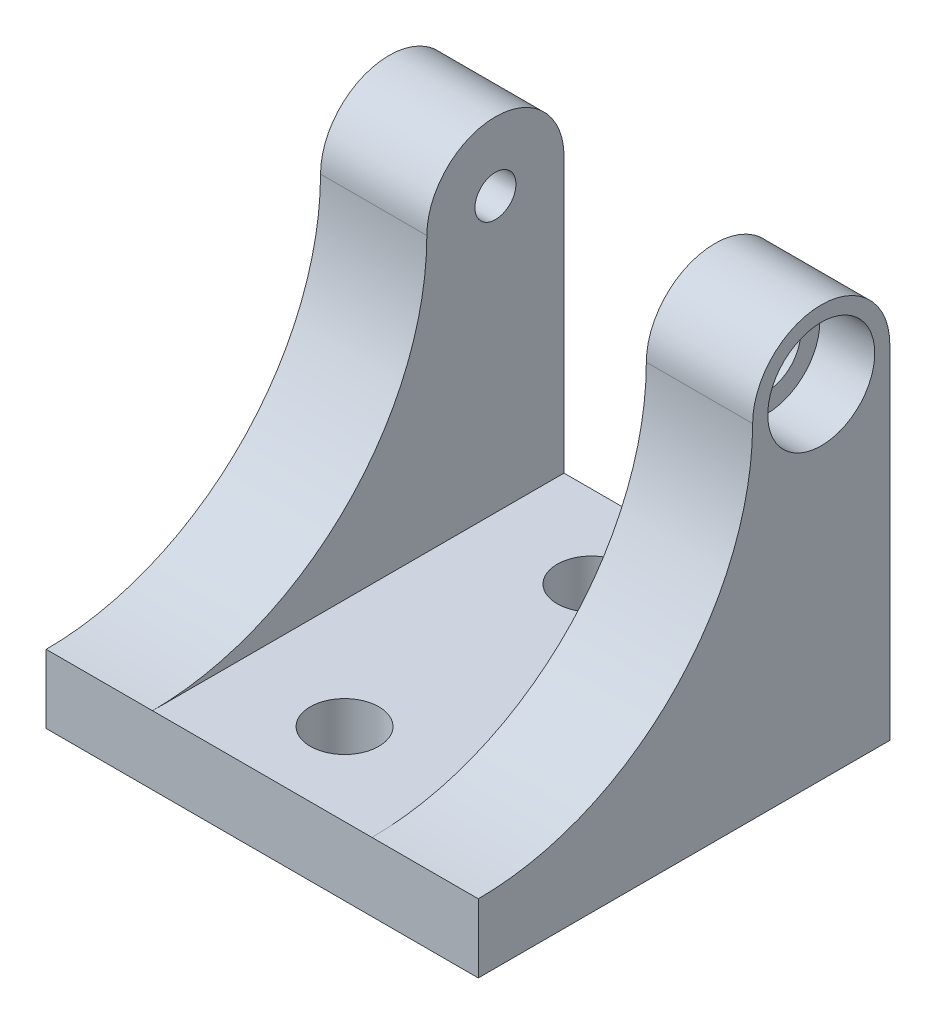
ISO-10303-21;
HEADER;
FILE_DESCRIPTION(('STEP AP214'),'2;1');
FILE_NAME('part.step','',(''),(''),'','','');
FILE_SCHEMA(('AUTOMOTIVE_DESIGN { 1 0 10303 214 1 1 1 1 }'));
ENDSEC;
DATA;
#1=APPLICATION_CONTEXT('core data for automotive mechanical design processes');
#2=APPLICATION_PROTOCOL_DEFINITION('international standard','automotive_design',2000,#1);
#3=PRODUCT_CONTEXT('',#1,'mechanical');
#4=PRODUCT('Part','Part','',(#3));
#5=PRODUCT_RELATED_PRODUCT_CATEGORY('part','',(#4));
#6=PRODUCT_DEFINITION_FORMATION('','',#4);
#7=PRODUCT_DEFINITION_CONTEXT('part definition',#1,'design');
#8=PRODUCT_DEFINITION('design','',#6,#7);
#9=PRODUCT_DEFINITION_SHAPE('','',#8);
#10=(LENGTH_UNIT() NAMED_UNIT(*) SI_UNIT(.MILLI.,.METRE.));
#11=(NAMED_UNIT(*) PLANE_ANGLE_UNIT() SI_UNIT($,.RADIAN.));
#12=(NAMED_UNIT(*) SI_UNIT($,.STERADIAN.) SOLID_ANGLE_UNIT());
#13=UNCERTAINTY_MEASURE_WITH_UNIT(LENGTH_MEASURE(1.E-05),#10,'distance_accuracy_value','');
#14=(GEOMETRIC_REPRESENTATION_CONTEXT(3) GLOBAL_UNCERTAINTY_ASSIGNED_CONTEXT((#13)) GLOBAL_UNIT_ASSIGNED_CONTEXT((#10,
#11,#12)) REPRESENTATION_CONTEXT('',''));
#15=CARTESIAN_POINT('',(0.,0.,0.));
#16=DIRECTION('',(0.,0.,1.));
#17=DIRECTION('',(1.,0.,0.));
#18=AXIS2_PLACEMENT_3D('',#15,#16,#17);
#19=CARTESIAN_POINT('',(21.1822438789309,31.75,-31.75));
#20=DIRECTION('',(1.,0.,0.));
#21=DIRECTION('',(0.,0.,-1.));
#22=AXIS2_PLACEMENT_3D('',#19,#20,#21);
#23=CYLINDRICAL_SURFACE('',#22,3.175);
#24=CARTESIAN_POINT('',(30.1625,31.75,-31.75));
#25=DIRECTION('',(1.,0.,0.));
#26=DIRECTION('',(0.,0.,-1.));
#27=AXIS2_PLACEMENT_3D('',#24,#25,#26);
#28=CIRCLE('',#27,3.175);
#29=CARTESIAN_POINT('',(30.1625,31.75,-34.925));
#30=VERTEX_POINT('',#29);
#31=EDGE_CURVE('E157',#30,#30,#28,.F.);
#32=ORIENTED_EDGE('',*,*,#31,.T.);
#33=EDGE_LOOP('',(#32));
#34=FACE_BOUND('',#33,.T.);
#35=CARTESIAN_POINT('',(34.925,31.75,-31.75));
#36=DIRECTION('',(1.,0.,0.));
#37=DIRECTION('',(0.,0.,-1.));
#38=AXIS2_PLACEMENT_3D('',#35,#36,#37);
#39=CIRCLE('',#38,3.175);
#40=CARTESIAN_POINT('',(34.925,31.75,-34.925));
#41=VERTEX_POINT('',#40);
#42=EDGE_CURVE('E155',#41,#41,#39,.F.);
#43=ORIENTED_EDGE('',*,*,#42,.F.);
#44=EDGE_LOOP('',(#43));
#45=FACE_BOUND('',#44,.T.);
#46=ADVANCED_FACE('F36',(#34,#45),#23,.F.);
#47=CARTESIAN_POINT('',(40.005,31.75,-31.75));
#48=DIRECTION('',(-1.,0.,0.));
#49=DIRECTION('',(0.,0.,1.));
#50=AXIS2_PLACEMENT_3D('',#47,#48,#49);
#51=CYLINDRICAL_SURFACE('',#50,6.35);
#52=DIRECTION('',(-1.,0.,0.));
#53=VECTOR('',#52,1.);
#54=CARTESIAN_POINT('',(40.005,31.75,-38.1));
#55=LINE('',#54,#53);
#56=CARTESIAN_POINT('',(40.005,31.75,-38.1));
#57=VERTEX_POINT('',#56);
#58=CARTESIAN_POINT('',(30.1625,31.75,-38.1));
#59=VERTEX_POINT('',#58);
#60=EDGE_CURVE('E113',#57,#59,#55,.T.);
#61=ORIENTED_EDGE('',*,*,#60,.T.);
#62=CARTESIAN_POINT('',(30.1625,31.75,-31.75));
#63=DIRECTION('',(1.,0.,0.));
#64=DIRECTION('',(0.,0.,-1.));
#65=AXIS2_PLACEMENT_3D('',#62,#63,#64);
#66=CIRCLE('',#65,6.35);
#67=CARTESIAN_POINT('',(30.1625,31.75,-25.4));
#68=VERTEX_POINT('',#67);
#69=EDGE_CURVE('E134',#59,#68,#66,.T.);
#70=ORIENTED_EDGE('',*,*,#69,.T.);
#71=DIRECTION('',(-1.,0.,0.));
#72=VECTOR('',#71,1.);
#73=CARTESIAN_POINT('',(40.005,31.75,-25.4));
#74=LINE('',#73,#72);
#75=CARTESIAN_POINT('',(40.005,31.75,-25.4));
#76=VERTEX_POINT('',#75);
#77=EDGE_CURVE('E126',#76,#68,#74,.T.);
#78=ORIENTED_EDGE('',*,*,#77,.F.);
#79=CARTESIAN_POINT('',(40.005,31.75,-31.75));
#80=DIRECTION('',(1.,0.,0.));
#81=DIRECTION('',(0.,0.,-1.));
#82=AXIS2_PLACEMENT_3D('',#79,#80,#81);
#83=CIRCLE('',#82,6.35);
#84=EDGE_CURVE('E106',#57,#76,#83,.T.);
#85=ORIENTED_EDGE('',*,*,#84,.F.);
#86=EDGE_LOOP('',(#61,#70,#78,#85));
#87=FACE_BOUND('',#86,.T.);
#88=ADVANCED_FACE('F124',(#87),#51,.T.);
#89=CARTESIAN_POINT('',(40.005,31.75,0.));
#90=DIRECTION('',(-1.,0.,0.));
#91=DIRECTION('',(0.,0.,1.));
#92=AXIS2_PLACEMENT_3D('',#89,#90,#91);
#93=CYLINDRICAL_SURFACE('',#92,25.4);
#94=ORIENTED_EDGE('',*,*,#77,.T.);
#95=CARTESIAN_POINT('',(30.1625,31.75,0.));
#96=DIRECTION('',(1.,0.,0.));
#97=DIRECTION('',(0.,0.,-1.));
#98=AXIS2_PLACEMENT_3D('',#95,#96,#97);
#99=CIRCLE('',#98,25.4);
#100=CARTESIAN_POINT('',(30.1625,6.35,0.));
#101=VERTEX_POINT('',#100);
#102=EDGE_CURVE('E11',#68,#101,#99,.F.);
#103=ORIENTED_EDGE('',*,*,#102,.T.);
#104=DIRECTION('',(-1.,0.,0.));
#105=VECTOR('',#104,1.);
#106=CARTESIAN_POINT('',(40.005,6.35,0.));
#107=LINE('',#106,#105);
#108=CARTESIAN_POINT('',(40.005,6.35,0.));
#109=VERTEX_POINT('',#108);
#110=EDGE_CURVE('E145',#109,#101,#107,.T.);
#111=ORIENTED_EDGE('',*,*,#110,.F.);
#112=CARTESIAN_POINT('',(40.005,31.75,0.));
#113=DIRECTION('',(-1.,0.,0.));
#114=DIRECTION('',(0.,0.,1.));
#115=AXIS2_PLACEMENT_3D('',#112,#113,#114);
#116=CIRCLE('',#115,25.4);
#117=EDGE_CURVE('E62',#76,#109,#116,.T.);
#118=ORIENTED_EDGE('',*,*,#117,.F.);
#119=EDGE_LOOP('',(#94,#103,#111,#118));
#120=FACE_BOUND('',#119,.T.);
#121=ADVANCED_FACE('F232',(#120),#93,.F.);
#122=CARTESIAN_POINT('',(40.005,0.,0.));
#123=DIRECTION('',(0.,0.,-1.));
#124=DIRECTION('',(-1.,0.,0.));
#125=AXIS2_PLACEMENT_3D('',#122,#123,#124);
#126=PLANE('',#125);
#127=DIRECTION('',(0.,-1.,0.));
#128=VECTOR('',#127,1.);
#129=CARTESIAN_POINT('',(0.,0.,0.));
#130=LINE('',#129,#128);
#131=CARTESIAN_POINT('',(0.,6.35,0.));
#132=VERTEX_POINT('',#131);
#133=CARTESIAN_POINT('',(0.,0.,0.));
#134=VERTEX_POINT('',#133);
#135=EDGE_CURVE('E131',#132,#134,#130,.T.);
#136=ORIENTED_EDGE('',*,*,#135,.T.);
#137=DIRECTION('',(-1.,0.,0.));
#138=VECTOR('',#137,1.);
#139=CARTESIAN_POINT('',(40.005,0.,0.));
#140=LINE('',#139,#138);
#141=CARTESIAN_POINT('',(40.005,0.,0.));
#142=VERTEX_POINT('',#141);
#143=EDGE_CURVE('E151',#142,#134,#140,.T.);
#144=ORIENTED_EDGE('',*,*,#143,.F.);
#145=DIRECTION('',(0.,-1.,0.));
#146=VECTOR('',#145,1.);
#147=CARTESIAN_POINT('',(40.005,0.,0.));
#148=LINE('',#147,#146);
#149=EDGE_CURVE('E144',#109,#142,#148,.T.);
#150=ORIENTED_EDGE('',*,*,#149,.F.);
#151=ORIENTED_EDGE('',*,*,#110,.T.);
#152=DIRECTION('',(-1.,0.,0.));
#153=VECTOR('',#152,1.);
#154=CARTESIAN_POINT('',(30.1625,6.35,0.));
#155=LINE('',#154,#153);
#156=CARTESIAN_POINT('',(9.8425,6.35,0.));
#157=VERTEX_POINT('',#156);
#158=EDGE_CURVE('E185',#101,#157,#155,.T.);
#159=ORIENTED_EDGE('',*,*,#158,.T.);
#160=EDGE_CURVE('E87',#157,#132,#107,.T.);
#161=ORIENTED_EDGE('',*,*,#160,.T.);
#162=EDGE_LOOP('',(#136,#144,#150,#151,#159,#161));
#163=FACE_BOUND('',#162,.T.);
#164=ADVANCED_FACE('F38',(#163),#126,.F.);
#165=CARTESIAN_POINT('',(40.005,0.,0.));
#166=DIRECTION('',(0.,1.,0.));
#167=DIRECTION('',(0.,0.,1.));
#168=AXIS2_PLACEMENT_3D('',#165,#166,#167);
#169=PLANE('',#168);
#170=CARTESIAN_POINT('',(20.0025,0.,-30.48));
#171=DIRECTION('',(0.,-1.,0.));
#172=DIRECTION('',(0.,0.,-1.));
#173=AXIS2_PLACEMENT_3D('',#170,#171,#172);
#174=CIRCLE('',#173,3.175);
#175=CARTESIAN_POINT('',(20.0025,0.,-33.655));
#176=VERTEX_POINT('',#175);
#177=EDGE_CURVE('E173',#176,#176,#174,.T.);
#178=ORIENTED_EDGE('',*,*,#177,.F.);
#179=EDGE_LOOP('',(#178));
#180=FACE_BOUND('',#179,.T.);
#181=CARTESIAN_POINT('',(20.0025,0.,-7.62));
#182=DIRECTION('',(0.,-1.,0.));
#183=DIRECTION('',(0.,0.,-1.));
#184=AXIS2_PLACEMENT_3D('',#181,#182,#183);
#185=CIRCLE('',#184,3.175);
#186=CARTESIAN_POINT('',(20.0025,0.,-10.795));
#187=VERTEX_POINT('',#186);
#188=EDGE_CURVE('E162',#187,#187,#185,.T.);
#189=ORIENTED_EDGE('',*,*,#188,.F.);
#190=EDGE_LOOP('',(#189));
#191=FACE_BOUND('',#190,.T.);
#192=DIRECTION('',(0.,0.,-1.));
#193=VECTOR('',#192,1.);
#194=CARTESIAN_POINT('',(0.,0.,0.));
#195=LINE('',#194,#193);
#196=CARTESIAN_POINT('',(0.,0.,-38.1));
#197=VERTEX_POINT('',#196);
#198=EDGE_CURVE('E133',#134,#197,#195,.T.);
#199=ORIENTED_EDGE('',*,*,#198,.T.);
#200=DIRECTION('',(-1.,0.,0.));
#201=VECTOR('',#200,1.);
#202=CARTESIAN_POINT('',(40.005,0.,-38.1));
#203=LINE('',#202,#201);
#204=CARTESIAN_POINT('',(40.005,0.,-38.1));
#205=VERTEX_POINT('',#204);
#206=EDGE_CURVE('E121',#205,#197,#203,.T.);
#207=ORIENTED_EDGE('',*,*,#206,.F.);
#208=DIRECTION('',(0.,0.,-1.));
#209=VECTOR('',#208,1.);
#210=CARTESIAN_POINT('',(40.005,0.,0.));
#211=LINE('',#210,#209);
#212=EDGE_CURVE('E96',#142,#205,#211,.T.);
#213=ORIENTED_EDGE('',*,*,#212,.F.);
#214=ORIENTED_EDGE('',*,*,#143,.T.);
#215=EDGE_LOOP('',(#199,#207,#213,#214));
#216=FACE_BOUND('',#215,.T.);
#217=ADVANCED_FACE('F204',(#180,#191,#216),#169,.F.);
#218=CARTESIAN_POINT('',(40.005,0.,-38.1));
#219=DIRECTION('',(0.,0.,1.));
#220=DIRECTION('',(1.,0.,0.));
#221=AXIS2_PLACEMENT_3D('',#218,#219,#220);
#222=PLANE('',#221);
#223=DIRECTION('',(-1.,0.,0.));
#224=VECTOR('',#223,1.);
#225=CARTESIAN_POINT('',(30.1625,6.35,-38.1));
#226=LINE('',#225,#224);
#227=CARTESIAN_POINT('',(30.1625,6.35,-38.1));
#228=VERTEX_POINT('',#227);
#229=CARTESIAN_POINT('',(9.8425,6.35,-38.1));
#230=VERTEX_POINT('',#229);
#231=EDGE_CURVE('E190',#228,#230,#226,.T.);
#232=ORIENTED_EDGE('',*,*,#231,.F.);
#233=DIRECTION('',(0.,-1.,0.));
#234=VECTOR('',#233,1.);
#235=CARTESIAN_POINT('',(30.1625,6.35,-38.1));
#236=LINE('',#235,#234);
#237=EDGE_CURVE('E118',#59,#228,#236,.T.);
#238=ORIENTED_EDGE('',*,*,#237,.F.);
#239=ORIENTED_EDGE('',*,*,#60,.F.);
#240=DIRECTION('',(0.,1.,0.));
#241=VECTOR('',#240,1.);
#242=CARTESIAN_POINT('',(40.005,0.,-38.1));
#243=LINE('',#242,#241);
#244=EDGE_CURVE('E102',#205,#57,#243,.T.);
#245=ORIENTED_EDGE('',*,*,#244,.F.);
#246=ORIENTED_EDGE('',*,*,#206,.T.);
#247=DIRECTION('',(0.,1.,0.));
#248=VECTOR('',#247,1.);
#249=CARTESIAN_POINT('',(0.,0.,-38.1));
#250=LINE('',#249,#248);
#251=CARTESIAN_POINT('',(0.,31.75,-38.1));
#252=VERTEX_POINT('',#251);
#253=EDGE_CURVE('E136',#197,#252,#250,.T.);
#254=ORIENTED_EDGE('',*,*,#253,.T.);
#255=CARTESIAN_POINT('',(9.8425,31.75,-38.1));
#256=VERTEX_POINT('',#255);
#257=EDGE_CURVE('E122',#256,#252,#55,.T.);
#258=ORIENTED_EDGE('',*,*,#257,.F.);
#259=DIRECTION('',(0.,1.,0.));
#260=VECTOR('',#259,1.);
#261=CARTESIAN_POINT('',(9.8425,6.35,-38.1));
#262=LINE('',#261,#260);
#263=EDGE_CURVE('E188',#230,#256,#262,.T.);
#264=ORIENTED_EDGE('',*,*,#263,.F.);
#265=EDGE_LOOP('',(#232,#238,#239,#245,#246,#254,#258,#264));
#266=FACE_BOUND('',#265,.T.);
#267=ADVANCED_FACE('F115',(#266),#222,.F.);
#268=CARTESIAN_POINT('',(9.8425,31.75,-25.4));
#269=VERTEX_POINT('',#268);
#270=CARTESIAN_POINT('',(0.,31.75,-25.4));
#271=VERTEX_POINT('',#270);
#272=EDGE_CURVE('E148',#269,#271,#74,.T.);
#273=ORIENTED_EDGE('',*,*,#272,.F.);
#274=CARTESIAN_POINT('',(9.8425,31.75,-31.75));
#275=DIRECTION('',(-1.,0.,0.));
#276=DIRECTION('',(0.,0.,1.));
#277=AXIS2_PLACEMENT_3D('',#274,#275,#276);
#278=CIRCLE('',#277,6.35);
#279=EDGE_CURVE('E195',#269,#256,#278,.T.);
#280=ORIENTED_EDGE('',*,*,#279,.T.);
#281=ORIENTED_EDGE('',*,*,#257,.T.);
#282=CARTESIAN_POINT('',(0.,31.75,-31.75));
#283=DIRECTION('',(1.,0.,0.));
#284=DIRECTION('',(0.,0.,-1.));
#285=AXIS2_PLACEMENT_3D('',#282,#283,#284);
#286=CIRCLE('',#285,6.35);
#287=EDGE_CURVE('E139',#252,#271,#286,.T.);
#288=ORIENTED_EDGE('',*,*,#287,.T.);
#289=EDGE_LOOP('',(#273,#280,#281,#288));
#290=FACE_BOUND('',#289,.T.);
#291=ADVANCED_FACE('F213',(#290),#51,.T.);
#292=ORIENTED_EDGE('',*,*,#160,.F.);
#293=CARTESIAN_POINT('',(9.8425,31.75,0.));
#294=DIRECTION('',(-1.,0.,0.));
#295=DIRECTION('',(0.,0.,1.));
#296=AXIS2_PLACEMENT_3D('',#293,#294,#295);
#297=CIRCLE('',#296,25.4);
#298=EDGE_CURVE('E45',#157,#269,#297,.F.);
#299=ORIENTED_EDGE('',*,*,#298,.T.);
#300=ORIENTED_EDGE('',*,*,#272,.T.);
#301=CARTESIAN_POINT('',(0.,31.75,0.));
#302=DIRECTION('',(-1.,0.,0.));
#303=DIRECTION('',(0.,0.,1.));
#304=AXIS2_PLACEMENT_3D('',#301,#302,#303);
#305=CIRCLE('',#304,25.4);
#306=EDGE_CURVE('E142',#271,#132,#305,.T.);
#307=ORIENTED_EDGE('',*,*,#306,.T.);
#308=EDGE_LOOP('',(#292,#299,#300,#307));
#309=FACE_BOUND('',#308,.T.);
#310=ADVANCED_FACE('F237',(#309),#93,.F.);
#311=CARTESIAN_POINT('',(40.005,31.75,0.));
#312=DIRECTION('',(-1.,0.,0.));
#313=DIRECTION('',(0.,0.,1.));
#314=AXIS2_PLACEMENT_3D('',#311,#312,#313);
#315=PLANE('',#314);
#316=CARTESIAN_POINT('',(40.005,31.75,-31.75));
#317=DIRECTION('',(1.,0.,0.));
#318=DIRECTION('',(0.,0.,-1.));
#319=AXIS2_PLACEMENT_3D('',#316,#317,#318);
#320=CIRCLE('',#319,4.953);
#321=CARTESIAN_POINT('',(40.005,31.75,-36.703));
#322=VERTEX_POINT('',#321);
#323=EDGE_CURVE('E178',#322,#322,#320,.T.);
#324=ORIENTED_EDGE('',*,*,#323,.F.);
#325=EDGE_LOOP('',(#324));
#326=FACE_BOUND('',#325,.T.);
#327=ORIENTED_EDGE('',*,*,#149,.T.);
#328=ORIENTED_EDGE('',*,*,#212,.T.);
#329=ORIENTED_EDGE('',*,*,#244,.T.);
#330=ORIENTED_EDGE('',*,*,#84,.T.);
#331=ORIENTED_EDGE('',*,*,#117,.T.);
#332=EDGE_LOOP('',(#327,#328,#329,#330,#331));
#333=FACE_BOUND('',#332,.T.);
#334=ADVANCED_FACE('F104',(#326,#333),#315,.F.);
#335=CARTESIAN_POINT('',(0.,31.75,0.));
#336=DIRECTION('',(-1.,0.,0.));
#337=DIRECTION('',(0.,0.,1.));
#338=AXIS2_PLACEMENT_3D('',#335,#336,#337);
#339=PLANE('',#338);
#340=CARTESIAN_POINT('',(0.,31.75,-31.75));
#341=DIRECTION('',(-1.,0.,0.));
#342=DIRECTION('',(0.,0.,1.));
#343=AXIS2_PLACEMENT_3D('',#340,#341,#342);
#344=CIRCLE('',#343,1.89865);
#345=CARTESIAN_POINT('',(0.,31.75,-29.85135));
#346=VERTEX_POINT('',#345);
#347=EDGE_CURVE('E161',#346,#346,#344,.T.);
#348=ORIENTED_EDGE('',*,*,#347,.F.);
#349=EDGE_LOOP('',(#348));
#350=FACE_BOUND('',#349,.T.);
#351=ORIENTED_EDGE('',*,*,#135,.F.);
#352=ORIENTED_EDGE('',*,*,#306,.F.);
#353=ORIENTED_EDGE('',*,*,#287,.F.);
#354=ORIENTED_EDGE('',*,*,#253,.F.);
#355=ORIENTED_EDGE('',*,*,#198,.F.);
#356=EDGE_LOOP('',(#351,#352,#353,#354,#355));
#357=FACE_BOUND('',#356,.T.);
#358=ADVANCED_FACE('F209',(#350,#357),#339,.T.);
#359=CARTESIAN_POINT('',(30.1625,6.35,0.));
#360=DIRECTION('',(1.,0.,0.));
#361=DIRECTION('',(0.,0.,-1.));
#362=AXIS2_PLACEMENT_3D('',#359,#360,#361);
#363=PLANE('',#362);
#364=ORIENTED_EDGE('',*,*,#31,.F.);
#365=EDGE_LOOP('',(#364));
#366=FACE_BOUND('',#365,.T.);
#367=ORIENTED_EDGE('',*,*,#237,.T.);
#368=DIRECTION('',(0.,0.,-1.));
#369=VECTOR('',#368,1.);
#370=CARTESIAN_POINT('',(30.1625,6.35,0.));
#371=LINE('',#370,#369);
#372=EDGE_CURVE('E187',#101,#228,#371,.T.);
#373=ORIENTED_EDGE('',*,*,#372,.F.);
#374=ORIENTED_EDGE('',*,*,#102,.F.);
#375=ORIENTED_EDGE('',*,*,#69,.F.);
#376=EDGE_LOOP('',(#367,#373,#374,#375));
#377=FACE_BOUND('',#376,.T.);
#378=ADVANCED_FACE('F230',(#366,#377),#363,.F.);
#379=CARTESIAN_POINT('',(9.8425,6.35,0.));
#380=DIRECTION('',(-1.,0.,0.));
#381=DIRECTION('',(0.,0.,1.));
#382=AXIS2_PLACEMENT_3D('',#379,#380,#381);
#383=PLANE('',#382);
#384=CARTESIAN_POINT('',(9.8425,31.75,-31.75));
#385=DIRECTION('',(-1.,0.,0.));
#386=DIRECTION('',(0.,0.,1.));
#387=AXIS2_PLACEMENT_3D('',#384,#385,#386);
#388=CIRCLE('',#387,1.89865);
#389=CARTESIAN_POINT('',(9.8425,31.75,-29.85135));
#390=VERTEX_POINT('',#389);
#391=EDGE_CURVE('E166',#390,#390,#388,.T.);
#392=ORIENTED_EDGE('',*,*,#391,.T.);
#393=EDGE_LOOP('',(#392));
#394=FACE_BOUND('',#393,.T.);
#395=ORIENTED_EDGE('',*,*,#298,.F.);
#396=DIRECTION('',(0.,0.,-1.));
#397=VECTOR('',#396,1.);
#398=CARTESIAN_POINT('',(9.8425,6.35,0.));
#399=LINE('',#398,#397);
#400=EDGE_CURVE('E53',#157,#230,#399,.T.);
#401=ORIENTED_EDGE('',*,*,#400,.T.);
#402=ORIENTED_EDGE('',*,*,#263,.T.);
#403=ORIENTED_EDGE('',*,*,#279,.F.);
#404=EDGE_LOOP('',(#395,#401,#402,#403));
#405=FACE_BOUND('',#404,.T.);
#406=ADVANCED_FACE('F235',(#394,#405),#383,.F.);
#407=CARTESIAN_POINT('',(30.1625,6.35,0.));
#408=DIRECTION('',(0.,-1.,0.));
#409=DIRECTION('',(0.,0.,-1.));
#410=AXIS2_PLACEMENT_3D('',#407,#408,#409);
#411=PLANE('',#410);
#412=CARTESIAN_POINT('',(20.0025,6.35000000000001,-30.48));
#413=DIRECTION('',(0.,-1.,0.));
#414=DIRECTION('',(0.,0.,-1.));
#415=AXIS2_PLACEMENT_3D('',#412,#413,#414);
#416=CIRCLE('',#415,3.175);
#417=CARTESIAN_POINT('',(20.0025,6.35000000000001,-33.655));
#418=VERTEX_POINT('',#417);
#419=EDGE_CURVE('E40',#418,#418,#416,.T.);
#420=ORIENTED_EDGE('',*,*,#419,.T.);
#421=EDGE_LOOP('',(#420));
#422=FACE_BOUND('',#421,.T.);
#423=CARTESIAN_POINT('',(20.0025,6.35000000000001,-7.62));
#424=DIRECTION('',(0.,-1.,0.));
#425=DIRECTION('',(0.,0.,-1.));
#426=AXIS2_PLACEMENT_3D('',#423,#424,#425);
#427=CIRCLE('',#426,3.175);
#428=CARTESIAN_POINT('',(20.0025,6.35000000000001,-10.795));
#429=VERTEX_POINT('',#428);
#430=EDGE_CURVE('E159',#429,#429,#427,.T.);
#431=ORIENTED_EDGE('',*,*,#430,.T.);
#432=EDGE_LOOP('',(#431));
#433=FACE_BOUND('',#432,.T.);
#434=ORIENTED_EDGE('',*,*,#231,.T.);
#435=ORIENTED_EDGE('',*,*,#400,.F.);
#436=ORIENTED_EDGE('',*,*,#158,.F.);
#437=ORIENTED_EDGE('',*,*,#372,.T.);
#438=EDGE_LOOP('',(#434,#435,#436,#437));
#439=FACE_BOUND('',#438,.T.);
#440=ADVANCED_FACE('F233',(#422,#433,#439),#411,.F.);
#441=CARTESIAN_POINT('',(34.925,31.75,-31.75));
#442=DIRECTION('',(1.,0.,0.));
#443=DIRECTION('',(0.,0.,-1.));
#444=AXIS2_PLACEMENT_3D('',#441,#442,#443);
#445=PLANE('',#444);
#446=CARTESIAN_POINT('',(34.925,31.75,-31.75));
#447=DIRECTION('',(1.,0.,0.));
#448=DIRECTION('',(0.,0.,-1.));
#449=AXIS2_PLACEMENT_3D('',#446,#447,#448);
#450=CIRCLE('',#449,4.953);
#451=CARTESIAN_POINT('',(34.925,31.75,-36.703));
#452=VERTEX_POINT('',#451);
#453=EDGE_CURVE('E158',#452,#452,#450,.T.);
#454=ORIENTED_EDGE('',*,*,#453,.T.);
#455=EDGE_LOOP('',(#454));
#456=FACE_BOUND('',#455,.T.);
#457=ORIENTED_EDGE('',*,*,#42,.T.);
#458=EDGE_LOOP('',(#457));
#459=FACE_BOUND('',#458,.T.);
#460=ADVANCED_FACE('F265',(#456,#459),#445,.T.);
#461=CARTESIAN_POINT('',(34.925,31.75,-31.75));
#462=DIRECTION('',(1.,0.,0.));
#463=DIRECTION('',(0.,0.,-1.));
#464=AXIS2_PLACEMENT_3D('',#461,#462,#463);
#465=CYLINDRICAL_SURFACE('',#464,4.953);
#466=ORIENTED_EDGE('',*,*,#453,.F.);
#467=EDGE_LOOP('',(#466));
#468=FACE_BOUND('',#467,.T.);
#469=ORIENTED_EDGE('',*,*,#323,.T.);
#470=EDGE_LOOP('',(#469));
#471=FACE_BOUND('',#470,.T.);
#472=ADVANCED_FACE('F258',(#468,#471),#465,.F.);
#473=CARTESIAN_POINT('',(0.,31.75,-31.75));
#474=DIRECTION('',(-1.,0.,0.));
#475=DIRECTION('',(0.,0.,1.));
#476=AXIS2_PLACEMENT_3D('',#473,#474,#475);
#477=CYLINDRICAL_SURFACE('',#476,1.89865);
#478=ORIENTED_EDGE('',*,*,#347,.T.);
#479=EDGE_LOOP('',(#478));
#480=FACE_BOUND('',#479,.T.);
#481=ORIENTED_EDGE('',*,*,#391,.F.);
#482=EDGE_LOOP('',(#481));
#483=FACE_BOUND('',#482,.T.);
#484=ADVANCED_FACE('F275',(#480,#483),#477,.F.);
#485=CARTESIAN_POINT('',(20.0025,38.1,-7.62));
#486=DIRECTION('',(0.,-1.,0.));
#487=DIRECTION('',(0.,0.,-1.));
#488=AXIS2_PLACEMENT_3D('',#485,#486,#487);
#489=CYLINDRICAL_SURFACE('',#488,3.175);
#490=ORIENTED_EDGE('',*,*,#188,.T.);
#491=EDGE_LOOP('',(#490));
#492=FACE_BOUND('',#491,.T.);
#493=ORIENTED_EDGE('',*,*,#430,.F.);
#494=EDGE_LOOP('',(#493));
#495=FACE_BOUND('',#494,.T.);
#496=ADVANCED_FACE('F278',(#492,#495),#489,.F.);
#497=CARTESIAN_POINT('',(20.0025,38.1,-30.48));
#498=DIRECTION('',(0.,-1.,0.));
#499=DIRECTION('',(0.,0.,-1.));
#500=AXIS2_PLACEMENT_3D('',#497,#498,#499);
#501=CYLINDRICAL_SURFACE('',#500,3.175);
#502=ORIENTED_EDGE('',*,*,#177,.T.);
#503=EDGE_LOOP('',(#502));
#504=FACE_BOUND('',#503,.T.);
#505=ORIENTED_EDGE('',*,*,#419,.F.);
#506=EDGE_LOOP('',(#505));
#507=FACE_BOUND('',#506,.T.);
#508=ADVANCED_FACE('F285',(#504,#507),#501,.F.);
#509=CLOSED_SHELL('',(#46,#88,#121,#164,#217,#267,#291,#310,#334,#358,#378,#406,#440,#460,#472,
#484,#496,#508));
#510=MANIFOLD_SOLID_BREP('B2',#509);
#511=ADVANCED_BREP_SHAPE_REPRESENTATION('',(#18,#510),#14);
#512=SHAPE_DEFINITION_REPRESENTATION(#9,#511);
ENDSEC;
END-ISO-10303-21;
